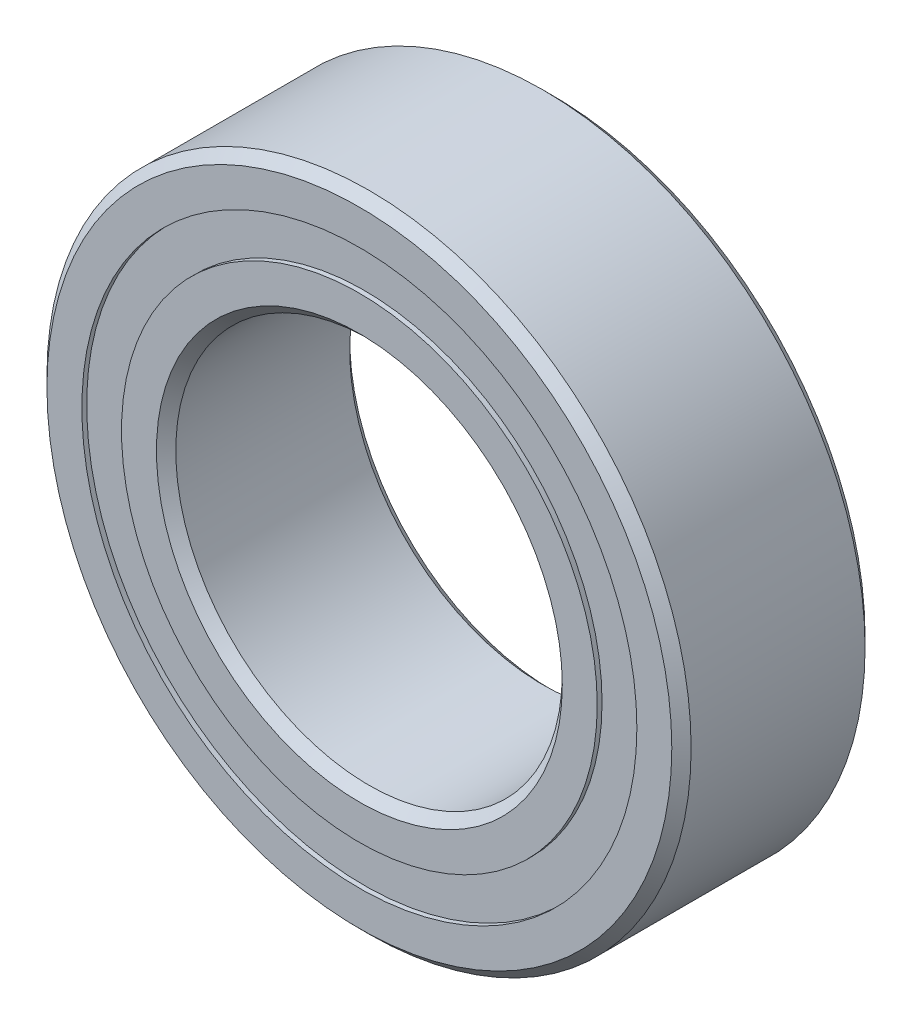
ISO-10303-21;
HEADER;
FILE_DESCRIPTION(('STEP AP214'),'2;1');
FILE_NAME('part.step','',(''),(''),'','','');
FILE_SCHEMA(('AUTOMOTIVE_DESIGN { 1 0 10303 214 1 1 1 1 }'));
ENDSEC;
DATA;
#1=APPLICATION_CONTEXT('core data for automotive mechanical design processes');
#2=APPLICATION_PROTOCOL_DEFINITION('international standard','automotive_design',2000,#1);
#3=PRODUCT_CONTEXT('',#1,'mechanical');
#4=PRODUCT('Part','Part','',(#3));
#5=PRODUCT_RELATED_PRODUCT_CATEGORY('part','',(#4));
#6=PRODUCT_DEFINITION_FORMATION('','',#4);
#7=PRODUCT_DEFINITION_CONTEXT('part definition',#1,'design');
#8=PRODUCT_DEFINITION('design','',#6,#7);
#9=PRODUCT_DEFINITION_SHAPE('','',#8);
#10=(LENGTH_UNIT() NAMED_UNIT(*) SI_UNIT(.MILLI.,.METRE.));
#11=(NAMED_UNIT(*) PLANE_ANGLE_UNIT() SI_UNIT($,.RADIAN.));
#12=(NAMED_UNIT(*) SI_UNIT($,.STERADIAN.) SOLID_ANGLE_UNIT());
#13=UNCERTAINTY_MEASURE_WITH_UNIT(LENGTH_MEASURE(1.E-05),#10,'distance_accuracy_value','');
#14=(GEOMETRIC_REPRESENTATION_CONTEXT(3) GLOBAL_UNCERTAINTY_ASSIGNED_CONTEXT((#13)) GLOBAL_UNIT_ASSIGNED_CONTEXT((#10,
#11,#12)) REPRESENTATION_CONTEXT('',''));
#15=CARTESIAN_POINT('',(0.,0.,0.));
#16=DIRECTION('',(0.,0.,1.));
#17=DIRECTION('',(1.,0.,0.));
#18=AXIS2_PLACEMENT_3D('',#15,#16,#17);
#19=CARTESIAN_POINT('',(0.,4.30769230769231,-1.425));
#20=DIRECTION('',(0.,0.,1.));
#21=DIRECTION('',(1.,0.,0.));
#22=AXIS2_PLACEMENT_3D('',#19,#20,#21);
#23=PLANE('',#22);
#24=CARTESIAN_POINT('',(0.,0.,-1.425));
#25=DIRECTION('',(0.,0.,1.));
#26=DIRECTION('',(1.,0.,0.));
#27=AXIS2_PLACEMENT_3D('',#24,#25,#26);
#28=CIRCLE('',#27,4.30769230769231);
#29=CARTESIAN_POINT('',(4.30769230769231,0.,-1.425));
#30=VERTEX_POINT('',#29);
#31=EDGE_CURVE('E54',#30,#30,#28,.T.);
#32=ORIENTED_EDGE('',*,*,#31,.F.);
#33=EDGE_LOOP('',(#32));
#34=FACE_BOUND('',#33,.T.);
#35=CARTESIAN_POINT('',(0.,0.,-1.425));
#36=DIRECTION('',(0.,0.,1.));
#37=DIRECTION('',(1.,0.,0.));
#38=AXIS2_PLACEMENT_3D('',#35,#36,#37);
#39=CIRCLE('',#38,3.69230769230769);
#40=CARTESIAN_POINT('',(3.69230769230769,0.,-1.425));
#41=VERTEX_POINT('',#40);
#42=EDGE_CURVE('E11',#41,#41,#39,.T.);
#43=ORIENTED_EDGE('',*,*,#42,.T.);
#44=EDGE_LOOP('',(#43));
#45=FACE_BOUND('',#44,.T.);
#46=ADVANCED_FACE('F40',(#34,#45),#23,.F.);
#47=CARTESIAN_POINT('',(0.,0.,1.5));
#48=DIRECTION('',(0.,0.,1.));
#49=DIRECTION('',(1.,0.,0.));
#50=AXIS2_PLACEMENT_3D('',#47,#48,#49);
#51=CYLINDRICAL_SURFACE('',#50,3.69230769230769);
#52=ORIENTED_EDGE('',*,*,#42,.F.);
#53=EDGE_LOOP('',(#52));
#54=FACE_BOUND('',#53,.T.);
#55=CARTESIAN_POINT('',(0.,0.,-0.734247234014173));
#56=DIRECTION('',(0.,0.,1.));
#57=DIRECTION('',(1.,0.,0.));
#58=AXIS2_PLACEMENT_3D('',#55,#56,#57);
#59=CIRCLE('',#58,3.69230769230769);
#60=CARTESIAN_POINT('',(3.69230769230769,0.,-0.734247234014173));
#61=VERTEX_POINT('',#60);
#62=EDGE_CURVE('E46',#61,#61,#59,.T.);
#63=ORIENTED_EDGE('',*,*,#62,.T.);
#64=EDGE_LOOP('',(#63));
#65=FACE_BOUND('',#64,.T.);
#66=ADVANCED_FACE('F63',(#54,#65),#51,.F.);
#67=CARTESIAN_POINT('',(0.,4.30769230769231,-0.734247234014172));
#68=DIRECTION('',(0.,0.,-1.));
#69=DIRECTION('',(-1.,0.,0.));
#70=AXIS2_PLACEMENT_3D('',#67,#68,#69);
#71=PLANE('',#70);
#72=ORIENTED_EDGE('',*,*,#62,.F.);
#73=EDGE_LOOP('',(#72));
#74=FACE_BOUND('',#73,.T.);
#75=CARTESIAN_POINT('',(0.,0.,-0.734247234014173));
#76=DIRECTION('',(0.,0.,1.));
#77=DIRECTION('',(1.,0.,0.));
#78=AXIS2_PLACEMENT_3D('',#75,#76,#77);
#79=CIRCLE('',#78,4.30769230769231);
#80=CARTESIAN_POINT('',(4.30769230769231,0.,-0.734247234014173));
#81=VERTEX_POINT('',#80);
#82=EDGE_CURVE('E50',#81,#81,#79,.T.);
#83=ORIENTED_EDGE('',*,*,#82,.T.);
#84=EDGE_LOOP('',(#83));
#85=FACE_BOUND('',#84,.T.);
#86=ADVANCED_FACE('F67',(#74,#85),#71,.F.);
#87=CARTESIAN_POINT('',(0.,0.,1.5));
#88=DIRECTION('',(0.,0.,1.));
#89=DIRECTION('',(1.,0.,0.));
#90=AXIS2_PLACEMENT_3D('',#87,#88,#89);
#91=CYLINDRICAL_SURFACE('',#90,4.30769230769231);
#92=ORIENTED_EDGE('',*,*,#82,.F.);
#93=EDGE_LOOP('',(#92));
#94=FACE_BOUND('',#93,.T.);
#95=ORIENTED_EDGE('',*,*,#31,.T.);
#96=EDGE_LOOP('',(#95));
#97=FACE_BOUND('',#96,.T.);
#98=ADVANCED_FACE('F60',(#94,#97),#91,.T.);
#99=CLOSED_SHELL('',(#46,#66,#86,#98));
#100=MANIFOLD_SOLID_BREP('B2',#99);
#101=CARTESIAN_POINT('',(0.,4.30769230769231,1.425));
#102=DIRECTION('',(0.,0.,-1.));
#103=DIRECTION('',(-1.,0.,0.));
#104=AXIS2_PLACEMENT_3D('',#101,#102,#103);
#105=PLANE('',#104);
#106=CARTESIAN_POINT('',(0.,0.,1.425));
#107=DIRECTION('',(0.,0.,1.));
#108=DIRECTION('',(1.,0.,0.));
#109=AXIS2_PLACEMENT_3D('',#106,#107,#108);
#110=CIRCLE('',#109,3.69230769230769);
#111=CARTESIAN_POINT('',(3.69230769230769,0.,1.425));
#112=VERTEX_POINT('',#111);
#113=EDGE_CURVE('E39',#112,#112,#110,.T.);
#114=ORIENTED_EDGE('',*,*,#113,.F.);
#115=EDGE_LOOP('',(#114));
#116=FACE_BOUND('',#115,.T.);
#117=CARTESIAN_POINT('',(0.,0.,1.425));
#118=DIRECTION('',(0.,0.,1.));
#119=DIRECTION('',(1.,0.,0.));
#120=AXIS2_PLACEMENT_3D('',#117,#118,#119);
#121=CIRCLE('',#120,4.30769230769231);
#122=CARTESIAN_POINT('',(4.30769230769231,0.,1.425));
#123=VERTEX_POINT('',#122);
#124=EDGE_CURVE('E122',#123,#123,#121,.T.);
#125=ORIENTED_EDGE('',*,*,#124,.T.);
#126=EDGE_LOOP('',(#125));
#127=FACE_BOUND('',#126,.T.);
#128=ADVANCED_FACE('F108',(#116,#127),#105,.F.);
#129=CARTESIAN_POINT('',(0.,0.,1.5));
#130=DIRECTION('',(0.,0.,1.));
#131=DIRECTION('',(1.,0.,0.));
#132=AXIS2_PLACEMENT_3D('',#129,#130,#131);
#133=CYLINDRICAL_SURFACE('',#132,3.69230769230769);
#134=CARTESIAN_POINT('',(0.,0.,0.734247234014171));
#135=DIRECTION('',(0.,0.,1.));
#136=DIRECTION('',(1.,0.,0.));
#137=AXIS2_PLACEMENT_3D('',#134,#135,#136);
#138=CIRCLE('',#137,3.69230769230769);
#139=CARTESIAN_POINT('',(3.69230769230769,0.,0.734247234014171));
#140=VERTEX_POINT('',#139);
#141=EDGE_CURVE('E114',#140,#140,#138,.T.);
#142=ORIENTED_EDGE('',*,*,#141,.F.);
#143=EDGE_LOOP('',(#142));
#144=FACE_BOUND('',#143,.T.);
#145=ORIENTED_EDGE('',*,*,#113,.T.);
#146=EDGE_LOOP('',(#145));
#147=FACE_BOUND('',#146,.T.);
#148=ADVANCED_FACE('F137',(#144,#147),#133,.F.);
#149=CARTESIAN_POINT('',(0.,4.30769230769231,0.734247234014171));
#150=DIRECTION('',(0.,0.,1.));
#151=DIRECTION('',(1.,0.,0.));
#152=AXIS2_PLACEMENT_3D('',#149,#150,#151);
#153=PLANE('',#152);
#154=CARTESIAN_POINT('',(0.,0.,0.734247234014171));
#155=DIRECTION('',(0.,0.,1.));
#156=DIRECTION('',(1.,0.,0.));
#157=AXIS2_PLACEMENT_3D('',#154,#155,#156);
#158=CIRCLE('',#157,4.30769230769231);
#159=CARTESIAN_POINT('',(4.30769230769231,0.,0.734247234014171));
#160=VERTEX_POINT('',#159);
#161=EDGE_CURVE('E118',#160,#160,#158,.T.);
#162=ORIENTED_EDGE('',*,*,#161,.F.);
#163=EDGE_LOOP('',(#162));
#164=FACE_BOUND('',#163,.T.);
#165=ORIENTED_EDGE('',*,*,#141,.T.);
#166=EDGE_LOOP('',(#165));
#167=FACE_BOUND('',#166,.T.);
#168=ADVANCED_FACE('F132',(#164,#167),#153,.F.);
#169=CARTESIAN_POINT('',(0.,0.,1.5));
#170=DIRECTION('',(0.,0.,1.));
#171=DIRECTION('',(1.,0.,0.));
#172=AXIS2_PLACEMENT_3D('',#169,#170,#171);
#173=CYLINDRICAL_SURFACE('',#172,4.30769230769231);
#174=ORIENTED_EDGE('',*,*,#124,.F.);
#175=EDGE_LOOP('',(#174));
#176=FACE_BOUND('',#175,.T.);
#177=ORIENTED_EDGE('',*,*,#161,.T.);
#178=EDGE_LOOP('',(#177));
#179=FACE_BOUND('',#178,.T.);
#180=ADVANCED_FACE('F129',(#176,#179),#173,.T.);
#181=CLOSED_SHELL('',(#128,#148,#168,#180));
#182=MANIFOLD_SOLID_BREP('B6',#181);
#183=CARTESIAN_POINT('',(-1.99999999999996,3.46410161513778,0.));
#184=DIRECTION('',(0.,0.,1.));
#185=DIRECTION('',(-0.499999999999989,0.866025403784445,0.));
#186=AXIS2_PLACEMENT_3D('',#183,#184,#185);
#187=SPHERICAL_SURFACE('',#186,0.734247234014172);
#188=CARTESIAN_POINT('',(-1.99999999999996,3.46410161513778,0.734247234014171));
#189=VERTEX_POINT('',#188);
#190=VERTEX_LOOP('',#189);
#191=FACE_BOUND('',#190,.T.);
#192=ADVANCED_FACE('F175',(#191),#187,.T.);
#193=CLOSED_SHELL('',(#192));
#194=MANIFOLD_SOLID_BREP('B34',#193);
#195=CARTESIAN_POINT('',(-3.46410161513773,2.00000000000004,0.));
#196=DIRECTION('',(0.,0.,1.));
#197=DIRECTION('',(-0.866025403784433,0.50000000000001,0.));
#198=AXIS2_PLACEMENT_3D('',#195,#196,#197);
#199=SPHERICAL_SURFACE('',#198,0.734247234014172);
#200=CARTESIAN_POINT('',(-3.46410161513773,2.00000000000004,0.734247234014171));
#201=VERTEX_POINT('',#200);
#202=VERTEX_LOOP('',#201);
#203=FACE_BOUND('',#202,.T.);
#204=ADVANCED_FACE('F195',(#203),#199,.T.);
#205=CLOSED_SHELL('',(#204));
#206=MANIFOLD_SOLID_BREP('B104',#205);
#207=CARTESIAN_POINT('',(-4.,0.,0.));
#208=DIRECTION('',(0.,0.,1.));
#209=DIRECTION('',(-1.,0.,0.));
#210=AXIS2_PLACEMENT_3D('',#207,#208,#209);
#211=SPHERICAL_SURFACE('',#210,0.734247234014172);
#212=CARTESIAN_POINT('',(-4.,0.,0.734247234014171));
#213=VERTEX_POINT('',#212);
#214=VERTEX_LOOP('',#213);
#215=FACE_BOUND('',#214,.T.);
#216=ADVANCED_FACE('F215',(#215),#211,.T.);
#217=CLOSED_SHELL('',(#216));
#218=MANIFOLD_SOLID_BREP('B171',#217);
#219=CARTESIAN_POINT('',(-3.46410161513777,-1.99999999999997,0.));
#220=DIRECTION('',(0.,0.,1.));
#221=DIRECTION('',(-0.866025403784443,-0.499999999999992,0.));
#222=AXIS2_PLACEMENT_3D('',#219,#220,#221);
#223=SPHERICAL_SURFACE('',#222,0.734247234014172);
#224=CARTESIAN_POINT('',(-3.46410161513777,-1.99999999999997,0.734247234014171));
#225=VERTEX_POINT('',#224);
#226=VERTEX_LOOP('',#225);
#227=FACE_BOUND('',#226,.T.);
#228=ADVANCED_FACE('F235',(#227),#223,.T.);
#229=CLOSED_SHELL('',(#228));
#230=MANIFOLD_SOLID_BREP('B191',#229);
#231=CARTESIAN_POINT('',(-2.00000000000003,-3.46410161513774,0.));
#232=DIRECTION('',(0.,0.,1.));
#233=DIRECTION('',(-0.500000000000007,-0.866025403784435,0.));
#234=AXIS2_PLACEMENT_3D('',#231,#232,#233);
#235=SPHERICAL_SURFACE('',#234,0.734247234014172);
#236=CARTESIAN_POINT('',(-2.00000000000003,-3.46410161513774,0.734247234014171));
#237=VERTEX_POINT('',#236);
#238=VERTEX_LOOP('',#237);
#239=FACE_BOUND('',#238,.T.);
#240=ADVANCED_FACE('F255',(#239),#235,.T.);
#241=CLOSED_SHELL('',(#240));
#242=MANIFOLD_SOLID_BREP('B211',#241);
#243=CARTESIAN_POINT('',(0.,-4.,0.));
#244=DIRECTION('',(0.,0.,1.));
#245=DIRECTION('',(0.,-1.,0.));
#246=AXIS2_PLACEMENT_3D('',#243,#244,#245);
#247=SPHERICAL_SURFACE('',#246,0.734247234014172);
#248=CARTESIAN_POINT('',(0.,-4.,0.734247234014171));
#249=VERTEX_POINT('',#248);
#250=VERTEX_LOOP('',#249);
#251=FACE_BOUND('',#250,.T.);
#252=ADVANCED_FACE('F275',(#251),#247,.T.);
#253=CLOSED_SHELL('',(#252));
#254=MANIFOLD_SOLID_BREP('B231',#253);
#255=CARTESIAN_POINT('',(1.99999999999998,-3.46410161513777,0.));
#256=DIRECTION('',(0.,0.,1.));
#257=DIRECTION('',(0.499999999999995,-0.866025403784442,0.));
#258=AXIS2_PLACEMENT_3D('',#255,#256,#257);
#259=SPHERICAL_SURFACE('',#258,0.734247234014172);
#260=CARTESIAN_POINT('',(1.99999999999998,-3.46410161513777,0.734247234014171));
#261=VERTEX_POINT('',#260);
#262=VERTEX_LOOP('',#261);
#263=FACE_BOUND('',#262,.T.);
#264=ADVANCED_FACE('F295',(#263),#259,.T.);
#265=CLOSED_SHELL('',(#264));
#266=MANIFOLD_SOLID_BREP('B251',#265);
#267=CARTESIAN_POINT('',(3.46410161513775,-2.00000000000002,0.));
#268=DIRECTION('',(0.,0.,1.));
#269=DIRECTION('',(0.866025403784436,-0.500000000000004,0.));
#270=AXIS2_PLACEMENT_3D('',#267,#268,#269);
#271=SPHERICAL_SURFACE('',#270,0.734247234014172);
#272=CARTESIAN_POINT('',(3.46410161513775,-2.00000000000002,0.734247234014171));
#273=VERTEX_POINT('',#272);
#274=VERTEX_LOOP('',#273);
#275=FACE_BOUND('',#274,.T.);
#276=ADVANCED_FACE('F315',(#275),#271,.T.);
#277=CLOSED_SHELL('',(#276));
#278=MANIFOLD_SOLID_BREP('B271',#277);
#279=CARTESIAN_POINT('',(4.,0.,0.));
#280=DIRECTION('',(0.,0.,1.));
#281=DIRECTION('',(1.,0.,0.));
#282=AXIS2_PLACEMENT_3D('',#279,#280,#281);
#283=SPHERICAL_SURFACE('',#282,0.734247234014172);
#284=CARTESIAN_POINT('',(4.,0.,0.734247234014171));
#285=VERTEX_POINT('',#284);
#286=VERTEX_LOOP('',#285);
#287=FACE_BOUND('',#286,.T.);
#288=ADVANCED_FACE('F335',(#287),#283,.T.);
#289=CLOSED_SHELL('',(#288));
#290=MANIFOLD_SOLID_BREP('B291',#289);
#291=CARTESIAN_POINT('',(3.46410161513776,1.99999999999999,0.));
#292=DIRECTION('',(0.,0.,1.));
#293=DIRECTION('',(0.86602540378444,0.499999999999998,0.));
#294=AXIS2_PLACEMENT_3D('',#291,#292,#293);
#295=SPHERICAL_SURFACE('',#294,0.734247234014172);
#296=CARTESIAN_POINT('',(3.46410161513776,1.99999999999999,0.734247234014171));
#297=VERTEX_POINT('',#296);
#298=VERTEX_LOOP('',#297);
#299=FACE_BOUND('',#298,.T.);
#300=ADVANCED_FACE('F355',(#299),#295,.T.);
#301=CLOSED_SHELL('',(#300));
#302=MANIFOLD_SOLID_BREP('B311',#301);
#303=CARTESIAN_POINT('',(2.,3.46410161513775,0.));
#304=DIRECTION('',(0.,0.,1.));
#305=DIRECTION('',(0.500000000000001,0.866025403784438,0.));
#306=AXIS2_PLACEMENT_3D('',#303,#304,#305);
#307=SPHERICAL_SURFACE('',#306,0.734247234014172);
#308=CARTESIAN_POINT('',(2.,3.46410161513775,0.734247234014171));
#309=VERTEX_POINT('',#308);
#310=VERTEX_LOOP('',#309);
#311=FACE_BOUND('',#310,.T.);
#312=ADVANCED_FACE('F375',(#311),#307,.T.);
#313=CLOSED_SHELL('',(#312));
#314=MANIFOLD_SOLID_BREP('B331',#313);
#315=CARTESIAN_POINT('',(0.,4.,0.));
#316=DIRECTION('',(0.,0.,1.));
#317=DIRECTION('',(0.,1.,0.));
#318=AXIS2_PLACEMENT_3D('',#315,#316,#317);
#319=SPHERICAL_SURFACE('',#318,0.734247234014172);
#320=CARTESIAN_POINT('',(0.,4.,0.734247234014171));
#321=VERTEX_POINT('',#320);
#322=VERTEX_LOOP('',#321);
#323=FACE_BOUND('',#322,.T.);
#324=ADVANCED_FACE('F398',(#323),#319,.T.);
#325=CLOSED_SHELL('',(#324));
#326=MANIFOLD_SOLID_BREP('B351',#325);
#327=CARTESIAN_POINT('',(0.,3.69230769230769,1.5));
#328=DIRECTION('',(0.,0.,-1.));
#329=DIRECTION('',(-1.,0.,0.));
#330=AXIS2_PLACEMENT_3D('',#327,#328,#329);
#331=PLANE('',#330);
#332=CARTESIAN_POINT('',(0.,0.,1.5));
#333=DIRECTION('',(0.,0.,1.));
#334=DIRECTION('',(1.,0.,0.));
#335=AXIS2_PLACEMENT_3D('',#332,#333,#334);
#336=CIRCLE('',#335,3.15);
#337=CARTESIAN_POINT('',(3.15,0.,1.5));
#338=VERTEX_POINT('',#337);
#339=EDGE_CURVE('E446',#338,#338,#336,.T.);
#340=ORIENTED_EDGE('',*,*,#339,.F.);
#341=EDGE_LOOP('',(#340));
#342=FACE_BOUND('',#341,.T.);
#343=CARTESIAN_POINT('',(0.,0.,1.5));
#344=DIRECTION('',(0.,0.,1.));
#345=DIRECTION('',(1.,0.,0.));
#346=AXIS2_PLACEMENT_3D('',#343,#344,#345);
#347=CIRCLE('',#346,3.69230769230769);
#348=CARTESIAN_POINT('',(3.69230769230769,0.,1.5));
#349=VERTEX_POINT('',#348);
#350=EDGE_CURVE('E397',#349,#349,#347,.T.);
#351=ORIENTED_EDGE('',*,*,#350,.T.);
#352=EDGE_LOOP('',(#351));
#353=FACE_BOUND('',#352,.T.);
#354=ADVANCED_FACE('F418',(#342,#353),#331,.F.);
#355=CARTESIAN_POINT('',(0.,0.,1.5));
#356=DIRECTION('',(0.,0.,1.));
#357=DIRECTION('',(1.,0.,0.));
#358=AXIS2_PLACEMENT_3D('',#355,#356,#357);
#359=CYLINDRICAL_SURFACE('',#358,3.69230769230769);
#360=ORIENTED_EDGE('',*,*,#350,.F.);
#361=EDGE_LOOP('',(#360));
#362=FACE_BOUND('',#361,.T.);
#363=CARTESIAN_POINT('',(0.,0.,0.666666666666666));
#364=DIRECTION('',(0.,0.,1.));
#365=DIRECTION('',(1.,0.,0.));
#366=AXIS2_PLACEMENT_3D('',#363,#364,#365);
#367=CIRCLE('',#366,3.69230769230769);
#368=CARTESIAN_POINT('',(3.69230769230769,0.,0.666666666666666));
#369=VERTEX_POINT('',#368);
#370=EDGE_CURVE('E424',#369,#369,#367,.T.);
#371=ORIENTED_EDGE('',*,*,#370,.T.);
#372=EDGE_LOOP('',(#371));
#373=FACE_BOUND('',#372,.T.);
#374=ADVANCED_FACE('F453',(#362,#373),#359,.T.);
#375=CARTESIAN_POINT('',(0.,0.,0.));
#376=DIRECTION('',(0.,0.,1.));
#377=DIRECTION('',(1.,0.,0.));
#378=AXIS2_PLACEMENT_3D('',#375,#376,#377);
#379=TOROIDAL_SURFACE('',#378,4.,0.73424723401417);
#380=ORIENTED_EDGE('',*,*,#370,.F.);
#381=EDGE_LOOP('',(#380));
#382=FACE_BOUND('',#381,.T.);
#383=CARTESIAN_POINT('',(0.,0.,-0.666666666666667));
#384=DIRECTION('',(0.,0.,1.));
#385=DIRECTION('',(1.,0.,0.));
#386=AXIS2_PLACEMENT_3D('',#383,#384,#385);
#387=CIRCLE('',#386,3.69230769230769);
#388=CARTESIAN_POINT('',(3.69230769230769,0.,-0.666666666666667));
#389=VERTEX_POINT('',#388);
#390=EDGE_CURVE('E428',#389,#389,#387,.T.);
#391=ORIENTED_EDGE('',*,*,#390,.T.);
#392=EDGE_LOOP('',(#391));
#393=FACE_BOUND('',#392,.T.);
#394=ADVANCED_FACE('F457',(#382,#393),#379,.F.);
#395=CARTESIAN_POINT('',(0.,0.,1.5));
#396=DIRECTION('',(0.,0.,1.));
#397=DIRECTION('',(1.,0.,0.));
#398=AXIS2_PLACEMENT_3D('',#395,#396,#397);
#399=CYLINDRICAL_SURFACE('',#398,3.69230769230769);
#400=ORIENTED_EDGE('',*,*,#390,.F.);
#401=EDGE_LOOP('',(#400));
#402=FACE_BOUND('',#401,.T.);
#403=CARTESIAN_POINT('',(0.,0.,-1.5));
#404=DIRECTION('',(0.,0.,1.));
#405=DIRECTION('',(1.,0.,0.));
#406=AXIS2_PLACEMENT_3D('',#403,#404,#405);
#407=CIRCLE('',#406,3.69230769230769);
#408=CARTESIAN_POINT('',(3.69230769230769,0.,-1.5));
#409=VERTEX_POINT('',#408);
#410=EDGE_CURVE('E432',#409,#409,#407,.T.);
#411=ORIENTED_EDGE('',*,*,#410,.T.);
#412=EDGE_LOOP('',(#411));
#413=FACE_BOUND('',#412,.T.);
#414=ADVANCED_FACE('F462',(#402,#413),#399,.T.);
#415=CARTESIAN_POINT('',(0.,3.15,-1.5));
#416=DIRECTION('',(0.,0.,1.));
#417=DIRECTION('',(1.,0.,0.));
#418=AXIS2_PLACEMENT_3D('',#415,#416,#417);
#419=PLANE('',#418);
#420=ORIENTED_EDGE('',*,*,#410,.F.);
#421=EDGE_LOOP('',(#420));
#422=FACE_BOUND('',#421,.T.);
#423=CARTESIAN_POINT('',(0.,0.,-1.5));
#424=DIRECTION('',(0.,0.,1.));
#425=DIRECTION('',(1.,0.,0.));
#426=AXIS2_PLACEMENT_3D('',#423,#424,#425);
#427=CIRCLE('',#426,3.15);
#428=CARTESIAN_POINT('',(3.15,0.,-1.5));
#429=VERTEX_POINT('',#428);
#430=EDGE_CURVE('E437',#429,#429,#427,.T.);
#431=ORIENTED_EDGE('',*,*,#430,.T.);
#432=EDGE_LOOP('',(#431));
#433=FACE_BOUND('',#432,.T.);
#434=ADVANCED_FACE('F468',(#422,#433),#419,.F.);
#435=CARTESIAN_POINT('',(0.,0.,-1.35));
#436=DIRECTION('',(0.,0.,-1.));
#437=DIRECTION('',(-1.,0.,0.));
#438=AXIS2_PLACEMENT_3D('',#435,#436,#437);
#439=CONICAL_SURFACE('',#438,3.,0.785398163397448);
#440=ORIENTED_EDGE('',*,*,#430,.F.);
#441=EDGE_LOOP('',(#440));
#442=FACE_BOUND('',#441,.T.);
#443=CARTESIAN_POINT('',(0.,0.,-1.35));
#444=DIRECTION('',(0.,0.,1.));
#445=DIRECTION('',(1.,0.,0.));
#446=AXIS2_PLACEMENT_3D('',#443,#444,#445);
#447=CIRCLE('',#446,3.);
#448=CARTESIAN_POINT('',(3.,0.,-1.35));
#449=VERTEX_POINT('',#448);
#450=EDGE_CURVE('E440',#449,#449,#447,.T.);
#451=ORIENTED_EDGE('',*,*,#450,.T.);
#452=EDGE_LOOP('',(#451));
#453=FACE_BOUND('',#452,.T.);
#454=ADVANCED_FACE('F472',(#442,#453),#439,.F.);
#455=CARTESIAN_POINT('',(0.,0.,1.5));
#456=DIRECTION('',(0.,0.,1.));
#457=DIRECTION('',(1.,0.,0.));
#458=AXIS2_PLACEMENT_3D('',#455,#456,#457);
#459=CYLINDRICAL_SURFACE('',#458,3.);
#460=ORIENTED_EDGE('',*,*,#450,.F.);
#461=EDGE_LOOP('',(#460));
#462=FACE_BOUND('',#461,.T.);
#463=CARTESIAN_POINT('',(0.,0.,1.35));
#464=DIRECTION('',(0.,0.,1.));
#465=DIRECTION('',(1.,0.,0.));
#466=AXIS2_PLACEMENT_3D('',#463,#464,#465);
#467=CIRCLE('',#466,3.);
#468=CARTESIAN_POINT('',(3.,0.,1.35));
#469=VERTEX_POINT('',#468);
#470=EDGE_CURVE('E443',#469,#469,#467,.T.);
#471=ORIENTED_EDGE('',*,*,#470,.T.);
#472=EDGE_LOOP('',(#471));
#473=FACE_BOUND('',#472,.T.);
#474=ADVANCED_FACE('F476',(#462,#473),#459,.F.);
#475=CARTESIAN_POINT('',(0.,0.,1.5));
#476=DIRECTION('',(0.,0.,1.));
#477=DIRECTION('',(1.,0.,0.));
#478=AXIS2_PLACEMENT_3D('',#475,#476,#477);
#479=CONICAL_SURFACE('',#478,3.15,0.785398163397449);
#480=ORIENTED_EDGE('',*,*,#470,.F.);
#481=EDGE_LOOP('',(#480));
#482=FACE_BOUND('',#481,.T.);
#483=ORIENTED_EDGE('',*,*,#339,.T.);
#484=EDGE_LOOP('',(#483));
#485=FACE_BOUND('',#484,.T.);
#486=ADVANCED_FACE('F450',(#482,#485),#479,.F.);
#487=CLOSED_SHELL('',(#354,#374,#394,#414,#434,#454,#474,#486));
#488=MANIFOLD_SOLID_BREP('B371',#487);
#489=CARTESIAN_POINT('',(0.,0.,1.35));
#490=DIRECTION('',(0.,0.,-1.));
#491=DIRECTION('',(-1.,0.,0.));
#492=AXIS2_PLACEMENT_3D('',#489,#490,#491);
#493=CONICAL_SURFACE('',#492,5.,0.785398163397448);
#494=CARTESIAN_POINT('',(0.,0.,1.5));
#495=DIRECTION('',(0.,0.,1.));
#496=DIRECTION('',(1.,0.,0.));
#497=AXIS2_PLACEMENT_3D('',#494,#495,#496);
#498=CIRCLE('',#497,4.85);
#499=CARTESIAN_POINT('',(4.85,0.,1.5));
#500=VERTEX_POINT('',#499);
#501=EDGE_CURVE('E568',#500,#500,#498,.T.);
#502=ORIENTED_EDGE('',*,*,#501,.F.);
#503=EDGE_LOOP('',(#502));
#504=FACE_BOUND('',#503,.T.);
#505=CARTESIAN_POINT('',(0.,0.,1.35));
#506=DIRECTION('',(0.,0.,1.));
#507=DIRECTION('',(1.,0.,0.));
#508=AXIS2_PLACEMENT_3D('',#505,#506,#507);
#509=CIRCLE('',#508,5.);
#510=CARTESIAN_POINT('',(5.,0.,1.35));
#511=VERTEX_POINT('',#510);
#512=EDGE_CURVE('E417',#511,#511,#509,.T.);
#513=ORIENTED_EDGE('',*,*,#512,.T.);
#514=EDGE_LOOP('',(#513));
#515=FACE_BOUND('',#514,.T.);
#516=ADVANCED_FACE('F540',(#504,#515),#493,.T.);
#517=CARTESIAN_POINT('',(0.,0.,1.5));
#518=DIRECTION('',(0.,0.,1.));
#519=DIRECTION('',(1.,0.,0.));
#520=AXIS2_PLACEMENT_3D('',#517,#518,#519);
#521=CYLINDRICAL_SURFACE('',#520,5.);
#522=ORIENTED_EDGE('',*,*,#512,.F.);
#523=EDGE_LOOP('',(#522));
#524=FACE_BOUND('',#523,.T.);
#525=CARTESIAN_POINT('',(0.,0.,-1.35));
#526=DIRECTION('',(0.,0.,1.));
#527=DIRECTION('',(1.,0.,0.));
#528=AXIS2_PLACEMENT_3D('',#525,#526,#527);
#529=CIRCLE('',#528,5.);
#530=CARTESIAN_POINT('',(5.,0.,-1.35));
#531=VERTEX_POINT('',#530);
#532=EDGE_CURVE('E546',#531,#531,#529,.T.);
#533=ORIENTED_EDGE('',*,*,#532,.T.);
#534=EDGE_LOOP('',(#533));
#535=FACE_BOUND('',#534,.T.);
#536=ADVANCED_FACE('F575',(#524,#535),#521,.T.);
#537=CARTESIAN_POINT('',(0.,0.,-1.5));
#538=DIRECTION('',(0.,0.,1.));
#539=DIRECTION('',(1.,0.,0.));
#540=AXIS2_PLACEMENT_3D('',#537,#538,#539);
#541=CONICAL_SURFACE('',#540,4.85,0.785398163397448);
#542=ORIENTED_EDGE('',*,*,#532,.F.);
#543=EDGE_LOOP('',(#542));
#544=FACE_BOUND('',#543,.T.);
#545=CARTESIAN_POINT('',(0.,0.,-1.5));
#546=DIRECTION('',(0.,0.,1.));
#547=DIRECTION('',(1.,0.,0.));
#548=AXIS2_PLACEMENT_3D('',#545,#546,#547);
#549=CIRCLE('',#548,4.85);
#550=CARTESIAN_POINT('',(4.85,0.,-1.5));
#551=VERTEX_POINT('',#550);
#552=EDGE_CURVE('E550',#551,#551,#549,.T.);
#553=ORIENTED_EDGE('',*,*,#552,.T.);
#554=EDGE_LOOP('',(#553));
#555=FACE_BOUND('',#554,.T.);
#556=ADVANCED_FACE('F579',(#544,#555),#541,.T.);
#557=CARTESIAN_POINT('',(0.,4.85,-1.5));
#558=DIRECTION('',(0.,0.,1.));
#559=DIRECTION('',(1.,0.,0.));
#560=AXIS2_PLACEMENT_3D('',#557,#558,#559);
#561=PLANE('',#560);
#562=ORIENTED_EDGE('',*,*,#552,.F.);
#563=EDGE_LOOP('',(#562));
#564=FACE_BOUND('',#563,.T.);
#565=CARTESIAN_POINT('',(0.,0.,-1.5));
#566=DIRECTION('',(0.,0.,1.));
#567=DIRECTION('',(1.,0.,0.));
#568=AXIS2_PLACEMENT_3D('',#565,#566,#567);
#569=CIRCLE('',#568,4.30769230769231);
#570=CARTESIAN_POINT('',(4.30769230769231,0.,-1.5));
#571=VERTEX_POINT('',#570);
#572=EDGE_CURVE('E554',#571,#571,#569,.T.);
#573=ORIENTED_EDGE('',*,*,#572,.T.);
#574=EDGE_LOOP('',(#573));
#575=FACE_BOUND('',#574,.T.);
#576=ADVANCED_FACE('F584',(#564,#575),#561,.F.);
#577=CARTESIAN_POINT('',(0.,0.,1.5));
#578=DIRECTION('',(0.,0.,1.));
#579=DIRECTION('',(1.,0.,0.));
#580=AXIS2_PLACEMENT_3D('',#577,#578,#579);
#581=CYLINDRICAL_SURFACE('',#580,4.30769230769231);
#582=ORIENTED_EDGE('',*,*,#572,.F.);
#583=EDGE_LOOP('',(#582));
#584=FACE_BOUND('',#583,.T.);
#585=CARTESIAN_POINT('',(0.,0.,-0.666666666666667));
#586=DIRECTION('',(0.,0.,1.));
#587=DIRECTION('',(1.,0.,0.));
#588=AXIS2_PLACEMENT_3D('',#585,#586,#587);
#589=CIRCLE('',#588,4.30769230769231);
#590=CARTESIAN_POINT('',(4.30769230769231,0.,-0.666666666666667));
#591=VERTEX_POINT('',#590);
#592=EDGE_CURVE('E559',#591,#591,#589,.T.);
#593=ORIENTED_EDGE('',*,*,#592,.T.);
#594=EDGE_LOOP('',(#593));
#595=FACE_BOUND('',#594,.T.);
#596=ADVANCED_FACE('F590',(#584,#595),#581,.F.);
#597=CARTESIAN_POINT('',(0.,0.,0.));
#598=DIRECTION('',(0.,0.,1.));
#599=DIRECTION('',(1.,0.,0.));
#600=AXIS2_PLACEMENT_3D('',#597,#598,#599);
#601=TOROIDAL_SURFACE('',#600,4.,0.734247234014172);
#602=ORIENTED_EDGE('',*,*,#592,.F.);
#603=EDGE_LOOP('',(#602));
#604=FACE_BOUND('',#603,.T.);
#605=CARTESIAN_POINT('',(0.,0.,0.666666666666666));
#606=DIRECTION('',(0.,0.,1.));
#607=DIRECTION('',(1.,0.,0.));
#608=AXIS2_PLACEMENT_3D('',#605,#606,#607);
#609=CIRCLE('',#608,4.30769230769231);
#610=CARTESIAN_POINT('',(4.30769230769231,0.,0.666666666666666));
#611=VERTEX_POINT('',#610);
#612=EDGE_CURVE('E562',#611,#611,#609,.T.);
#613=ORIENTED_EDGE('',*,*,#612,.T.);
#614=EDGE_LOOP('',(#613));
#615=FACE_BOUND('',#614,.T.);
#616=ADVANCED_FACE('F594',(#604,#615),#601,.F.);
#617=CARTESIAN_POINT('',(0.,0.,1.5));
#618=DIRECTION('',(0.,0.,1.));
#619=DIRECTION('',(1.,0.,0.));
#620=AXIS2_PLACEMENT_3D('',#617,#618,#619);
#621=CYLINDRICAL_SURFACE('',#620,4.30769230769231);
#622=ORIENTED_EDGE('',*,*,#612,.F.);
#623=EDGE_LOOP('',(#622));
#624=FACE_BOUND('',#623,.T.);
#625=CARTESIAN_POINT('',(0.,0.,1.5));
#626=DIRECTION('',(0.,0.,1.));
#627=DIRECTION('',(1.,0.,0.));
#628=AXIS2_PLACEMENT_3D('',#625,#626,#627);
#629=CIRCLE('',#628,4.30769230769231);
#630=CARTESIAN_POINT('',(4.30769230769231,0.,1.5));
#631=VERTEX_POINT('',#630);
#632=EDGE_CURVE('E565',#631,#631,#629,.T.);
#633=ORIENTED_EDGE('',*,*,#632,.T.);
#634=EDGE_LOOP('',(#633));
#635=FACE_BOUND('',#634,.T.);
#636=ADVANCED_FACE('F598',(#624,#635),#621,.F.);
#637=CARTESIAN_POINT('',(0.,4.85,1.5));
#638=DIRECTION('',(0.,0.,-1.));
#639=DIRECTION('',(-1.,0.,0.));
#640=AXIS2_PLACEMENT_3D('',#637,#638,#639);
#641=PLANE('',#640);
#642=ORIENTED_EDGE('',*,*,#632,.F.);
#643=EDGE_LOOP('',(#642));
#644=FACE_BOUND('',#643,.T.);
#645=ORIENTED_EDGE('',*,*,#501,.T.);
#646=EDGE_LOOP('',(#645));
#647=FACE_BOUND('',#646,.T.);
#648=ADVANCED_FACE('F572',(#644,#647),#641,.F.);
#649=CLOSED_SHELL('',(#516,#536,#556,#576,#596,#616,#636,#648));
#650=MANIFOLD_SOLID_BREP('B392',#649);
#651=ADVANCED_BREP_SHAPE_REPRESENTATION('',(#18,#100,#182,#194,#206,#218,#230,#242,#254,#266,
#278,#290,#302,#314,#326,#488,#650),#14);
#652=SHAPE_DEFINITION_REPRESENTATION(#9,#651);
ENDSEC;
END-ISO-10303-21;
